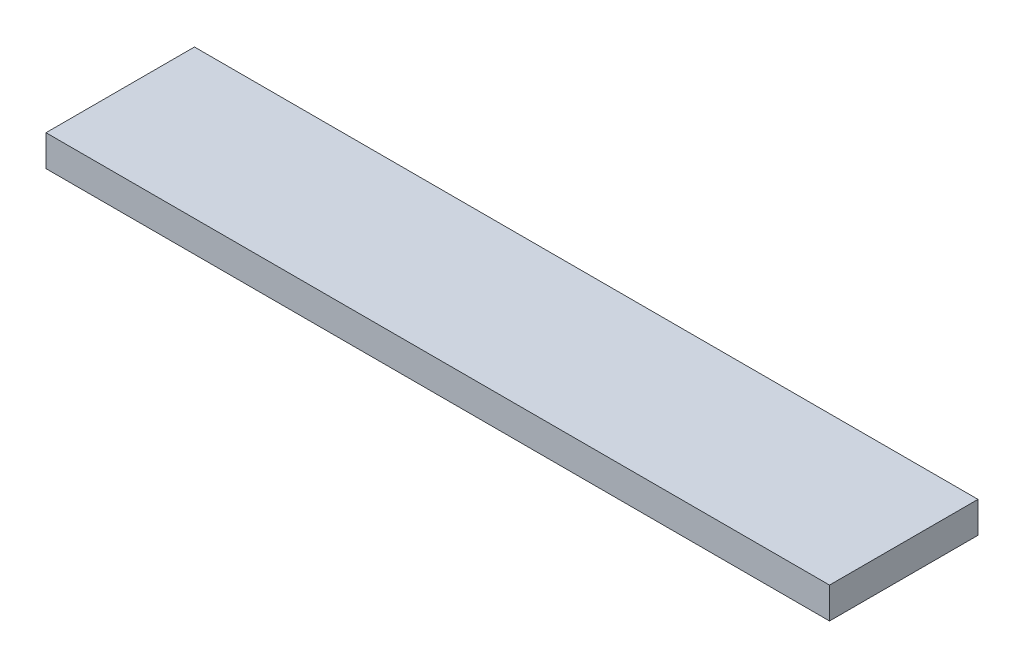
ISO-10303-21;
HEADER;
FILE_DESCRIPTION(('STEP AP214'),'2;1');
FILE_NAME('part.step','',(''),(''),'','','');
FILE_SCHEMA(('AUTOMOTIVE_DESIGN { 1 0 10303 214 1 1 1 1 }'));
ENDSEC;
DATA;
#1=APPLICATION_CONTEXT('core data for automotive mechanical design processes');
#2=APPLICATION_PROTOCOL_DEFINITION('international standard','automotive_design',2000,#1);
#3=PRODUCT_CONTEXT('',#1,'mechanical');
#4=PRODUCT('Part','Part','',(#3));
#5=PRODUCT_RELATED_PRODUCT_CATEGORY('part','',(#4));
#6=PRODUCT_DEFINITION_FORMATION('','',#4);
#7=PRODUCT_DEFINITION_CONTEXT('part definition',#1,'design');
#8=PRODUCT_DEFINITION('design','',#6,#7);
#9=PRODUCT_DEFINITION_SHAPE('','',#8);
#10=(LENGTH_UNIT() NAMED_UNIT(*) SI_UNIT(.MILLI.,.METRE.));
#11=(NAMED_UNIT(*) PLANE_ANGLE_UNIT() SI_UNIT($,.RADIAN.));
#12=(NAMED_UNIT(*) SI_UNIT($,.STERADIAN.) SOLID_ANGLE_UNIT());
#13=UNCERTAINTY_MEASURE_WITH_UNIT(LENGTH_MEASURE(1.E-05),#10,'distance_accuracy_value','');
#14=(GEOMETRIC_REPRESENTATION_CONTEXT(3) GLOBAL_UNCERTAINTY_ASSIGNED_CONTEXT((#13)) GLOBAL_UNIT_ASSIGNED_CONTEXT((#10,
#11,#12)) REPRESENTATION_CONTEXT('',''));
#15=CARTESIAN_POINT('',(0.,0.,0.));
#16=DIRECTION('',(0.,0.,1.));
#17=DIRECTION('',(1.,0.,0.));
#18=AXIS2_PLACEMENT_3D('',#15,#16,#17);
#19=CARTESIAN_POINT('',(0.,19.05,0.));
#20=DIRECTION('',(1.,0.,0.));
#21=DIRECTION('',(0.,0.,-1.));
#22=AXIS2_PLACEMENT_3D('',#19,#20,#21);
#23=PLANE('',#22);
#24=DIRECTION('',(0.,0.,1.));
#25=VECTOR('',#24,1.);
#26=CARTESIAN_POINT('',(0.,0.,0.));
#27=LINE('',#26,#25);
#28=CARTESIAN_POINT('',(0.,0.,-90.8304));
#29=VERTEX_POINT('',#28);
#30=CARTESIAN_POINT('',(0.,0.,0.));
#31=VERTEX_POINT('',#30);
#32=EDGE_CURVE('E102',#29,#31,#27,.T.);
#33=ORIENTED_EDGE('',*,*,#32,.T.);
#34=DIRECTION('',(0.,-1.,0.));
#35=VECTOR('',#34,1.);
#36=CARTESIAN_POINT('',(0.,19.05,0.));
#37=LINE('',#36,#35);
#38=CARTESIAN_POINT('',(0.,19.05,0.));
#39=VERTEX_POINT('',#38);
#40=EDGE_CURVE('E11',#39,#31,#37,.T.);
#41=ORIENTED_EDGE('',*,*,#40,.F.);
#42=DIRECTION('',(0.,0.,1.));
#43=VECTOR('',#42,1.);
#44=CARTESIAN_POINT('',(0.,19.05,0.));
#45=LINE('',#44,#43);
#46=CARTESIAN_POINT('',(0.,19.05,-90.8304));
#47=VERTEX_POINT('',#46);
#48=EDGE_CURVE('E90',#47,#39,#45,.T.);
#49=ORIENTED_EDGE('',*,*,#48,.F.);
#50=DIRECTION('',(0.,-1.,0.));
#51=VECTOR('',#50,1.);
#52=CARTESIAN_POINT('',(0.,19.05,-90.8304));
#53=LINE('',#52,#51);
#54=EDGE_CURVE('E98',#47,#29,#53,.T.);
#55=ORIENTED_EDGE('',*,*,#54,.T.);
#56=EDGE_LOOP('',(#33,#41,#49,#55));
#57=FACE_BOUND('',#56,.T.);
#58=ADVANCED_FACE('F39',(#57),#23,.F.);
#59=CARTESIAN_POINT('',(0.,19.05,0.));
#60=DIRECTION('',(0.,0.,-1.));
#61=DIRECTION('',(-1.,0.,0.));
#62=AXIS2_PLACEMENT_3D('',#59,#60,#61);
#63=PLANE('',#62);
#64=DIRECTION('',(1.,0.,0.));
#65=VECTOR('',#64,1.);
#66=CARTESIAN_POINT('',(0.,0.,0.));
#67=LINE('',#66,#65);
#68=CARTESIAN_POINT('',(479.3488,0.,0.));
#69=VERTEX_POINT('',#68);
#70=EDGE_CURVE('E94',#31,#69,#67,.T.);
#71=ORIENTED_EDGE('',*,*,#70,.T.);
#72=DIRECTION('',(0.,-1.,0.));
#73=VECTOR('',#72,1.);
#74=CARTESIAN_POINT('',(479.3488,19.05,0.));
#75=LINE('',#74,#73);
#76=CARTESIAN_POINT('',(479.3488,19.05,0.));
#77=VERTEX_POINT('',#76);
#78=EDGE_CURVE('E47',#77,#69,#75,.T.);
#79=ORIENTED_EDGE('',*,*,#78,.F.);
#80=DIRECTION('',(1.,0.,0.));
#81=VECTOR('',#80,1.);
#82=CARTESIAN_POINT('',(0.,19.05,0.));
#83=LINE('',#82,#81);
#84=EDGE_CURVE('E85',#39,#77,#83,.T.);
#85=ORIENTED_EDGE('',*,*,#84,.F.);
#86=ORIENTED_EDGE('',*,*,#40,.T.);
#87=EDGE_LOOP('',(#71,#79,#85,#86));
#88=FACE_BOUND('',#87,.T.);
#89=ADVANCED_FACE('F93',(#88),#63,.F.);
#90=CARTESIAN_POINT('',(479.3488,19.05,0.));
#91=DIRECTION('',(-1.,0.,0.));
#92=DIRECTION('',(0.,0.,1.));
#93=AXIS2_PLACEMENT_3D('',#90,#91,#92);
#94=PLANE('',#93);
#95=DIRECTION('',(0.,0.,-1.));
#96=VECTOR('',#95,1.);
#97=CARTESIAN_POINT('',(479.3488,0.,0.));
#98=LINE('',#97,#96);
#99=CARTESIAN_POINT('',(479.3488,0.,-90.8304));
#100=VERTEX_POINT('',#99);
#101=EDGE_CURVE('E72',#69,#100,#98,.T.);
#102=ORIENTED_EDGE('',*,*,#101,.T.);
#103=DIRECTION('',(0.,-1.,0.));
#104=VECTOR('',#103,1.);
#105=CARTESIAN_POINT('',(479.3488,19.05,-90.8304));
#106=LINE('',#105,#104);
#107=CARTESIAN_POINT('',(479.3488,19.05,-90.8304));
#108=VERTEX_POINT('',#107);
#109=EDGE_CURVE('E95',#108,#100,#106,.T.);
#110=ORIENTED_EDGE('',*,*,#109,.F.);
#111=DIRECTION('',(0.,0.,-1.));
#112=VECTOR('',#111,1.);
#113=CARTESIAN_POINT('',(479.3488,19.05,0.));
#114=LINE('',#113,#112);
#115=EDGE_CURVE('E88',#77,#108,#114,.T.);
#116=ORIENTED_EDGE('',*,*,#115,.F.);
#117=ORIENTED_EDGE('',*,*,#78,.T.);
#118=EDGE_LOOP('',(#102,#110,#116,#117));
#119=FACE_BOUND('',#118,.T.);
#120=ADVANCED_FACE('F96',(#119),#94,.F.);
#121=CARTESIAN_POINT('',(0.,19.05,-90.8304));
#122=DIRECTION('',(0.,0.,1.));
#123=DIRECTION('',(1.,0.,0.));
#124=AXIS2_PLACEMENT_3D('',#121,#122,#123);
#125=PLANE('',#124);
#126=DIRECTION('',(-1.,0.,0.));
#127=VECTOR('',#126,1.);
#128=CARTESIAN_POINT('',(0.,0.,-90.8304));
#129=LINE('',#128,#127);
#130=EDGE_CURVE('E78',#100,#29,#129,.T.);
#131=ORIENTED_EDGE('',*,*,#130,.T.);
#132=ORIENTED_EDGE('',*,*,#54,.F.);
#133=DIRECTION('',(-1.,0.,0.));
#134=VECTOR('',#133,1.);
#135=CARTESIAN_POINT('',(0.,19.05,-90.8304));
#136=LINE('',#135,#134);
#137=EDGE_CURVE('E55',#108,#47,#136,.T.);
#138=ORIENTED_EDGE('',*,*,#137,.F.);
#139=ORIENTED_EDGE('',*,*,#109,.T.);
#140=EDGE_LOOP('',(#131,#132,#138,#139));
#141=FACE_BOUND('',#140,.T.);
#142=ADVANCED_FACE('F109',(#141),#125,.F.);
#143=CARTESIAN_POINT('',(0.,19.05,0.));
#144=DIRECTION('',(0.,-1.,0.));
#145=DIRECTION('',(0.,0.,-1.));
#146=AXIS2_PLACEMENT_3D('',#143,#144,#145);
#147=PLANE('',#146);
#148=ORIENTED_EDGE('',*,*,#48,.T.);
#149=ORIENTED_EDGE('',*,*,#84,.T.);
#150=ORIENTED_EDGE('',*,*,#115,.T.);
#151=ORIENTED_EDGE('',*,*,#137,.T.);
#152=EDGE_LOOP('',(#148,#149,#150,#151));
#153=FACE_BOUND('',#152,.T.);
#154=ADVANCED_FACE('F86',(#153),#147,.F.);
#155=CARTESIAN_POINT('',(0.,0.,0.));
#156=DIRECTION('',(0.,-1.,0.));
#157=DIRECTION('',(0.,0.,-1.));
#158=AXIS2_PLACEMENT_3D('',#155,#156,#157);
#159=PLANE('',#158);
#160=ORIENTED_EDGE('',*,*,#32,.F.);
#161=ORIENTED_EDGE('',*,*,#130,.F.);
#162=ORIENTED_EDGE('',*,*,#101,.F.);
#163=ORIENTED_EDGE('',*,*,#70,.F.);
#164=EDGE_LOOP('',(#160,#161,#162,#163));
#165=FACE_BOUND('',#164,.T.);
#166=ADVANCED_FACE('F112',(#165),#159,.T.);
#167=CLOSED_SHELL('',(#58,#89,#120,#142,#154,#166));
#168=MANIFOLD_SOLID_BREP('B2',#167);
#169=ADVANCED_BREP_SHAPE_REPRESENTATION('',(#18,#168),#14);
#170=SHAPE_DEFINITION_REPRESENTATION(#9,#169);
ENDSEC;
END-ISO-10303-21;
